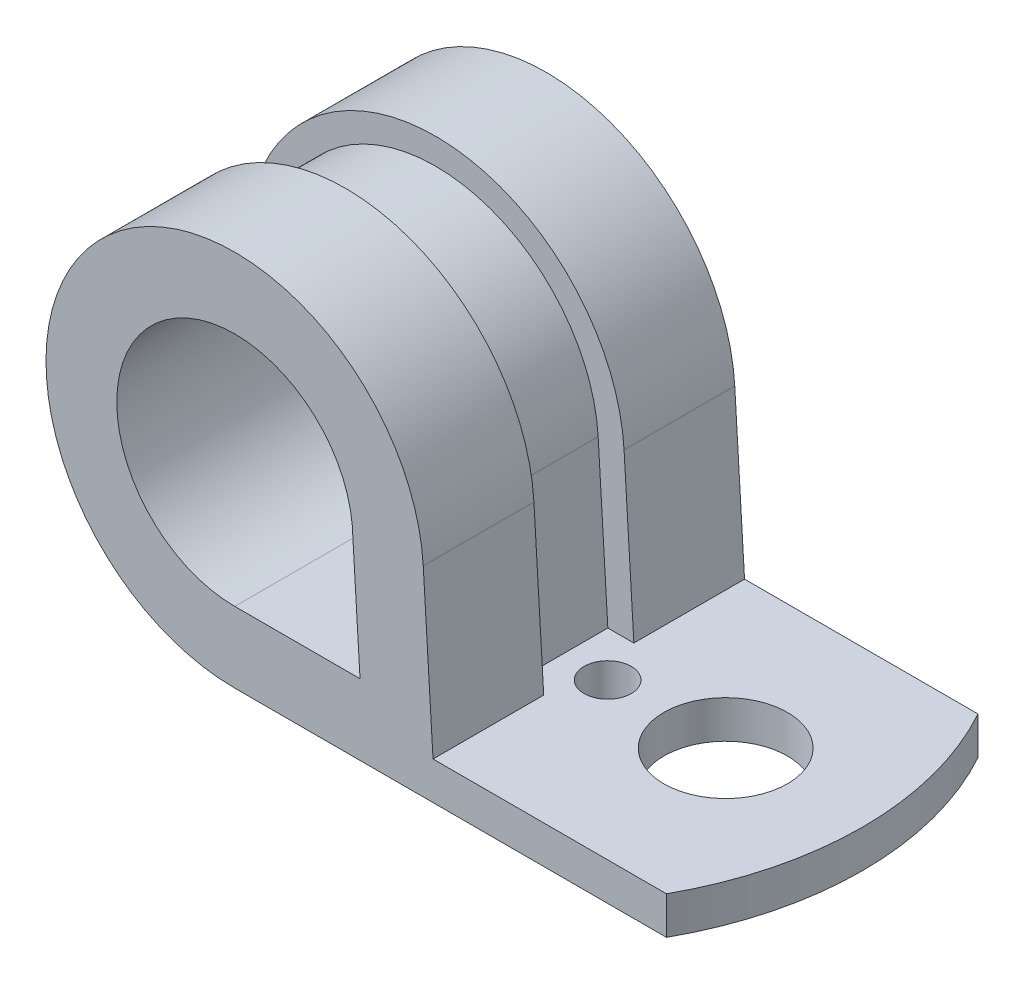
ISO-10303-21;
HEADER;
FILE_DESCRIPTION(('STEP AP214'),'2;1');
FILE_NAME('part.step','',(''),(''),'','','');
FILE_SCHEMA(('AUTOMOTIVE_DESIGN { 1 0 10303 214 1 1 1 1 }'));
ENDSEC;
DATA;
#1=APPLICATION_CONTEXT('core data for automotive mechanical design processes');
#2=APPLICATION_PROTOCOL_DEFINITION('international standard','automotive_design',2000,#1);
#3=PRODUCT_CONTEXT('',#1,'mechanical');
#4=PRODUCT('Part','Part','',(#3));
#5=PRODUCT_RELATED_PRODUCT_CATEGORY('part','',(#4));
#6=PRODUCT_DEFINITION_FORMATION('','',#4);
#7=PRODUCT_DEFINITION_CONTEXT('part definition',#1,'design');
#8=PRODUCT_DEFINITION('design','',#6,#7);
#9=PRODUCT_DEFINITION_SHAPE('','',#8);
#10=(LENGTH_UNIT() NAMED_UNIT(*) SI_UNIT(.MILLI.,.METRE.));
#11=(NAMED_UNIT(*) PLANE_ANGLE_UNIT() SI_UNIT($,.RADIAN.));
#12=(NAMED_UNIT(*) SI_UNIT($,.STERADIAN.) SOLID_ANGLE_UNIT());
#13=UNCERTAINTY_MEASURE_WITH_UNIT(LENGTH_MEASURE(1.E-05),#10,'distance_accuracy_value','');
#14=(GEOMETRIC_REPRESENTATION_CONTEXT(3) GLOBAL_UNCERTAINTY_ASSIGNED_CONTEXT((#13)) GLOBAL_UNIT_ASSIGNED_CONTEXT((#10,
#11,#12)) REPRESENTATION_CONTEXT('',''));
#15=CARTESIAN_POINT('',(0.,0.,0.));
#16=DIRECTION('',(0.,0.,1.));
#17=DIRECTION('',(1.,0.,0.));
#18=AXIS2_PLACEMENT_3D('',#15,#16,#17);
#19=CARTESIAN_POINT('',(0.,0.,8.382));
#20=DIRECTION('',(0.,1.,0.));
#21=DIRECTION('',(-1.,0.,0.));
#22=AXIS2_PLACEMENT_3D('',#19,#20,#21);
#23=PLANE('',#22);
#24=CARTESIAN_POINT('',(-7.366,0.,0.));
#25=DIRECTION('',(0.,1.,0.));
#26=DIRECTION('',(0.,0.,1.));
#27=AXIS2_PLACEMENT_3D('',#24,#25,#26);
#28=CIRCLE('',#27,3.3274);
#29=CARTESIAN_POINT('',(-7.366,0.,3.3274));
#30=VERTEX_POINT('',#29);
#31=EDGE_CURVE('E238',#30,#30,#28,.T.);
#32=ORIENTED_EDGE('',*,*,#31,.T.);
#33=EDGE_LOOP('',(#32));
#34=FACE_BOUND('',#33,.T.);
#35=CARTESIAN_POINT('',(-13.716,0.,0.));
#36=DIRECTION('',(0.,1.,0.));
#37=DIRECTION('',(0.,0.,1.));
#38=AXIS2_PLACEMENT_3D('',#35,#36,#37);
#39=CIRCLE('',#38,1.27);
#40=CARTESIAN_POINT('',(-13.716,0.,1.27));
#41=VERTEX_POINT('',#40);
#42=EDGE_CURVE('E242',#41,#41,#39,.T.);
#43=ORIENTED_EDGE('',*,*,#42,.T.);
#44=EDGE_LOOP('',(#43));
#45=FACE_BOUND('',#44,.T.);
#46=DIRECTION('',(1.,0.,0.));
#47=VECTOR('',#46,1.);
#48=CARTESIAN_POINT('',(-25.4,0.,-2.4257));
#49=LINE('',#48,#47);
#50=CARTESIAN_POINT('',(-25.4,0.,-2.4257));
#51=VERTEX_POINT('',#50);
#52=CARTESIAN_POINT('',(-18.4306740343172,0.,-2.4257));
#53=VERTEX_POINT('',#52);
#54=EDGE_CURVE('E150',#51,#53,#49,.T.);
#55=ORIENTED_EDGE('',*,*,#54,.F.);
#56=DIRECTION('',(0.,0.,-1.));
#57=VECTOR('',#56,1.);
#58=CARTESIAN_POINT('',(-25.4,0.,8.382));
#59=LINE('',#58,#57);
#60=CARTESIAN_POINT('',(-25.4,0.,-8.382));
#61=VERTEX_POINT('',#60);
#62=EDGE_CURVE('E161',#51,#61,#59,.T.);
#63=ORIENTED_EDGE('',*,*,#62,.T.);
#64=DIRECTION('',(1.,0.,0.));
#65=VECTOR('',#64,1.);
#66=CARTESIAN_POINT('',(0.,0.,-8.382));
#67=LINE('',#66,#65);
#68=CARTESIAN_POINT('',(-2.16809368914395,0.,-8.382));
#69=VERTEX_POINT('',#68);
#70=EDGE_CURVE('E180',#61,#69,#67,.T.);
#71=ORIENTED_EDGE('',*,*,#70,.T.);
#72=CARTESIAN_POINT('',(-17.2867424088353,0.,0.));
#73=DIRECTION('',(0.,1.,0.));
#74=DIRECTION('',(0.,0.,1.));
#75=AXIS2_PLACEMENT_3D('',#72,#73,#74);
#76=CIRCLE('',#75,17.2867424088353);
#77=CARTESIAN_POINT('',(-2.16809368914395,0.,8.382));
#78=VERTEX_POINT('',#77);
#79=EDGE_CURVE('E231',#78,#69,#76,.T.);
#80=ORIENTED_EDGE('',*,*,#79,.F.);
#81=DIRECTION('',(1.,0.,0.));
#82=VECTOR('',#81,1.);
#83=CARTESIAN_POINT('',(0.,0.,8.382));
#84=LINE('',#83,#82);
#85=CARTESIAN_POINT('',(-25.4,0.,8.382));
#86=VERTEX_POINT('',#85);
#87=EDGE_CURVE('E172',#86,#78,#84,.T.);
#88=ORIENTED_EDGE('',*,*,#87,.F.);
#89=CARTESIAN_POINT('',(-25.4,0.,2.4257));
#90=VERTEX_POINT('',#89);
#91=EDGE_CURVE('E171',#86,#90,#59,.T.);
#92=ORIENTED_EDGE('',*,*,#91,.T.);
#93=DIRECTION('',(1.,0.,0.));
#94=VECTOR('',#93,1.);
#95=CARTESIAN_POINT('',(-25.4,0.,2.4257));
#96=LINE('',#95,#94);
#97=CARTESIAN_POINT('',(-18.4306740343172,0.,2.4257));
#98=VERTEX_POINT('',#97);
#99=EDGE_CURVE('E275',#90,#98,#96,.T.);
#100=ORIENTED_EDGE('',*,*,#99,.T.);
#101=DIRECTION('',(0.,0.,1.));
#102=VECTOR('',#101,1.);
#103=CARTESIAN_POINT('',(-18.4306740343172,0.,-2.4257));
#104=LINE('',#103,#102);
#105=EDGE_CURVE('E164',#53,#98,#104,.T.);
#106=ORIENTED_EDGE('',*,*,#105,.F.);
#107=EDGE_LOOP('',(#55,#63,#71,#80,#88,#92,#100,#106));
#108=FACE_BOUND('',#107,.T.);
#109=ADVANCED_FACE('F33',(#34,#45,#108),#23,.F.);
#110=CARTESIAN_POINT('',(-15.2583811887178,10.7708746898078,8.382));
#111=DIRECTION('',(-0.998190827882103,-0.0601254615952593,0.));
#112=DIRECTION('',(0.0601254615952593,-0.998190827882103,0.));
#113=AXIS2_PLACEMENT_3D('',#110,#111,#112);
#114=PLANE('',#113);
#115=DIRECTION('',(-0.0601254615952593,0.998190827882103,0.));
#116=VECTOR('',#115,1.);
#117=CARTESIAN_POINT('',(-14.732,2.032,-2.4257));
#118=LINE('',#117,#116);
#119=CARTESIAN_POINT('',(-14.732,2.032,-2.4257));
#120=VERTEX_POINT('',#119);
#121=CARTESIAN_POINT('',(-15.2583811887178,10.7708746898078,-2.4257));
#122=VERTEX_POINT('',#121);
#123=EDGE_CURVE('E153',#120,#122,#118,.T.);
#124=ORIENTED_EDGE('',*,*,#123,.F.);
#125=DIRECTION('',(0.,0.,-1.));
#126=VECTOR('',#125,1.);
#127=CARTESIAN_POINT('',(-14.732,2.032,8.382));
#128=LINE('',#127,#126);
#129=CARTESIAN_POINT('',(-14.732,2.032,-8.382));
#130=VERTEX_POINT('',#129);
#131=EDGE_CURVE('E41',#120,#130,#128,.T.);
#132=ORIENTED_EDGE('',*,*,#131,.T.);
#133=DIRECTION('',(-0.0601254615952593,0.998190827882103,0.));
#134=VECTOR('',#133,1.);
#135=CARTESIAN_POINT('',(-15.2583811887178,10.7708746898078,-8.382));
#136=LINE('',#135,#134);
#137=CARTESIAN_POINT('',(-15.2583811887178,10.7708746898078,-8.382));
#138=VERTEX_POINT('',#137);
#139=EDGE_CURVE('E191',#130,#138,#136,.T.);
#140=ORIENTED_EDGE('',*,*,#139,.T.);
#141=DIRECTION('',(0.,0.,-1.));
#142=VECTOR('',#141,1.);
#143=CARTESIAN_POINT('',(-15.2583811887178,10.7708746898078,8.382));
#144=LINE('',#143,#142);
#145=EDGE_CURVE('E175',#122,#138,#144,.T.);
#146=ORIENTED_EDGE('',*,*,#145,.F.);
#147=EDGE_LOOP('',(#124,#132,#140,#146));
#148=FACE_BOUND('',#147,.T.);
#149=ADVANCED_FACE('F192',(#148),#114,.F.);
#150=CARTESIAN_POINT('',(-25.4,10.1599999999999,8.382));
#151=DIRECTION('',(0.,0.,-1.));
#152=DIRECTION('',(-1.,0.,0.));
#153=AXIS2_PLACEMENT_3D('',#150,#151,#152);
#154=CYLINDRICAL_SURFACE('',#153,10.16);
#155=CARTESIAN_POINT('',(-25.4,10.1599999999999,-2.4257));
#156=DIRECTION('',(0.,0.,1.));
#157=DIRECTION('',(1.,0.,0.));
#158=AXIS2_PLACEMENT_3D('',#155,#156,#157);
#159=CIRCLE('',#158,10.16);
#160=EDGE_CURVE('E146',#122,#51,#159,.T.);
#161=ORIENTED_EDGE('',*,*,#160,.F.);
#162=ORIENTED_EDGE('',*,*,#145,.T.);
#163=CARTESIAN_POINT('',(-25.4,10.1599999999999,-8.382));
#164=DIRECTION('',(0.,0.,1.));
#165=DIRECTION('',(1.,0.,0.));
#166=AXIS2_PLACEMENT_3D('',#163,#164,#165);
#167=CIRCLE('',#166,10.16);
#168=EDGE_CURVE('E169',#138,#61,#167,.T.);
#169=ORIENTED_EDGE('',*,*,#168,.T.);
#170=ORIENTED_EDGE('',*,*,#62,.F.);
#171=EDGE_LOOP('',(#161,#162,#169,#170));
#172=FACE_BOUND('',#171,.T.);
#173=ADVANCED_FACE('F167',(#172),#154,.T.);
#174=CARTESIAN_POINT('',(-14.732,2.032,8.382));
#175=DIRECTION('',(0.,-1.,0.));
#176=DIRECTION('',(0.,0.,-1.));
#177=AXIS2_PLACEMENT_3D('',#174,#175,#176);
#178=PLANE('',#177);
#179=ORIENTED_EDGE('',*,*,#131,.F.);
#180=DIRECTION('',(1.,0.,0.));
#181=VECTOR('',#180,1.);
#182=CARTESIAN_POINT('',(-14.732,2.032,-2.4257));
#183=LINE('',#182,#181);
#184=CARTESIAN_POINT('',(-16.1315319942621,2.032,-2.4257));
#185=VERTEX_POINT('',#184);
#186=EDGE_CURVE('E280',#185,#120,#183,.T.);
#187=ORIENTED_EDGE('',*,*,#186,.F.);
#188=DIRECTION('',(0.,0.,1.));
#189=VECTOR('',#188,1.);
#190=CARTESIAN_POINT('',(-16.1315319942621,2.032,-2.4257));
#191=LINE('',#190,#189);
#192=CARTESIAN_POINT('',(-16.1315319942621,2.032,2.4257));
#193=VERTEX_POINT('',#192);
#194=EDGE_CURVE('E248',#185,#193,#191,.T.);
#195=ORIENTED_EDGE('',*,*,#194,.T.);
#196=DIRECTION('',(1.,0.,0.));
#197=VECTOR('',#196,1.);
#198=CARTESIAN_POINT('',(-14.732,2.032,2.4257));
#199=LINE('',#198,#197);
#200=CARTESIAN_POINT('',(-14.732,2.032,2.4257));
#201=VERTEX_POINT('',#200);
#202=EDGE_CURVE('E261',#193,#201,#199,.T.);
#203=ORIENTED_EDGE('',*,*,#202,.T.);
#204=CARTESIAN_POINT('',(-14.732,2.032,8.382));
#205=VERTEX_POINT('',#204);
#206=EDGE_CURVE('E11',#205,#201,#128,.T.);
#207=ORIENTED_EDGE('',*,*,#206,.F.);
#208=DIRECTION('',(-1.,0.,0.));
#209=VECTOR('',#208,1.);
#210=CARTESIAN_POINT('',(-14.732,2.032,8.382));
#211=LINE('',#210,#209);
#212=CARTESIAN_POINT('',(-2.16809368914395,2.032,8.382));
#213=VERTEX_POINT('',#212);
#214=EDGE_CURVE('E201',#213,#205,#211,.T.);
#215=ORIENTED_EDGE('',*,*,#214,.F.);
#216=CARTESIAN_POINT('',(-17.2867424088353,2.032,0.));
#217=DIRECTION('',(0.,1.,0.));
#218=DIRECTION('',(0.,0.,1.));
#219=AXIS2_PLACEMENT_3D('',#216,#217,#218);
#220=CIRCLE('',#219,17.2867424088353);
#221=CARTESIAN_POINT('',(-2.16809368914395,2.032,-8.382));
#222=VERTEX_POINT('',#221);
#223=EDGE_CURVE('E232',#213,#222,#220,.T.);
#224=ORIENTED_EDGE('',*,*,#223,.T.);
#225=DIRECTION('',(-1.,0.,0.));
#226=VECTOR('',#225,1.);
#227=CARTESIAN_POINT('',(-14.732,2.032,-8.382));
#228=LINE('',#227,#226);
#229=EDGE_CURVE('E197',#222,#130,#228,.T.);
#230=ORIENTED_EDGE('',*,*,#229,.T.);
#231=EDGE_LOOP('',(#179,#187,#195,#203,#207,#215,#224,#230));
#232=FACE_BOUND('',#231,.T.);
#233=CARTESIAN_POINT('',(-7.366,2.032,0.));
#234=DIRECTION('',(0.,1.,0.));
#235=DIRECTION('',(0.,0.,1.));
#236=AXIS2_PLACEMENT_3D('',#233,#234,#235);
#237=CIRCLE('',#236,3.3274);
#238=CARTESIAN_POINT('',(-7.366,2.032,3.3274));
#239=VERTEX_POINT('',#238);
#240=EDGE_CURVE('E239',#239,#239,#237,.T.);
#241=ORIENTED_EDGE('',*,*,#240,.F.);
#242=EDGE_LOOP('',(#241));
#243=FACE_BOUND('',#242,.T.);
#244=CARTESIAN_POINT('',(-13.716,2.032,0.));
#245=DIRECTION('',(0.,1.,0.));
#246=DIRECTION('',(0.,0.,1.));
#247=AXIS2_PLACEMENT_3D('',#244,#245,#246);
#248=CIRCLE('',#247,1.27);
#249=CARTESIAN_POINT('',(-13.716,2.032,1.27));
#250=VERTEX_POINT('',#249);
#251=EDGE_CURVE('E245',#250,#250,#248,.T.);
#252=ORIENTED_EDGE('',*,*,#251,.F.);
#253=EDGE_LOOP('',(#252));
#254=FACE_BOUND('',#253,.T.);
#255=ADVANCED_FACE('F35',(#232,#243,#254),#178,.F.);
#256=CARTESIAN_POINT('',(-25.4,10.1599999999999,-8.382));
#257=DIRECTION('',(0.,0.,1.));
#258=DIRECTION('',(1.,0.,0.));
#259=AXIS2_PLACEMENT_3D('',#256,#257,#258);
#260=PLANE('',#259);
#261=CARTESIAN_POINT('',(-25.4,10.1599999999999,-8.382));
#262=DIRECTION('',(0.,0.,1.));
#263=DIRECTION('',(1.,0.,0.));
#264=AXIS2_PLACEMENT_3D('',#261,#262,#263);
#265=CIRCLE('',#264,6.35);
#266=CARTESIAN_POINT('',(-19.0794515971039,10.7708746898078,-8.382));
#267=VERTEX_POINT('',#266);
#268=CARTESIAN_POINT('',(-25.4,3.80999999999992,-8.382));
#269=VERTEX_POINT('',#268);
#270=EDGE_CURVE('E223',#267,#269,#265,.T.);
#271=ORIENTED_EDGE('',*,*,#270,.T.);
#272=DIRECTION('',(1.,0.,0.));
#273=VECTOR('',#272,1.);
#274=CARTESIAN_POINT('',(-25.4,3.80999999999992,-8.382));
#275=LINE('',#274,#273);
#276=CARTESIAN_POINT('',(-18.6601672356963,3.80999999999992,-8.382));
#277=VERTEX_POINT('',#276);
#278=EDGE_CURVE('E220',#269,#277,#275,.T.);
#279=ORIENTED_EDGE('',*,*,#278,.T.);
#280=DIRECTION('',(-0.0601254615952589,0.998190827882102,0.));
#281=VECTOR('',#280,1.);
#282=CARTESIAN_POINT('',(-19.0794515971039,10.7708746898078,-8.382));
#283=LINE('',#282,#281);
#284=EDGE_CURVE('E216',#277,#267,#283,.T.);
#285=ORIENTED_EDGE('',*,*,#284,.T.);
#286=EDGE_LOOP('',(#271,#279,#285));
#287=FACE_BOUND('',#286,.T.);
#288=DIRECTION('',(0.,1.,0.));
#289=VECTOR('',#288,1.);
#290=CARTESIAN_POINT('',(-2.16809368914395,0.,-8.382));
#291=LINE('',#290,#289);
#292=EDGE_CURVE('E234',#69,#222,#291,.T.);
#293=ORIENTED_EDGE('',*,*,#292,.F.);
#294=ORIENTED_EDGE('',*,*,#70,.F.);
#295=ORIENTED_EDGE('',*,*,#168,.F.);
#296=ORIENTED_EDGE('',*,*,#139,.F.);
#297=ORIENTED_EDGE('',*,*,#229,.F.);
#298=EDGE_LOOP('',(#293,#294,#295,#296,#297));
#299=FACE_BOUND('',#298,.T.);
#300=ADVANCED_FACE('F200',(#287,#299),#260,.F.);
#301=CARTESIAN_POINT('',(-25.4,10.1599999999999,8.382));
#302=DIRECTION('',(0.,0.,1.));
#303=DIRECTION('',(1.,0.,0.));
#304=AXIS2_PLACEMENT_3D('',#301,#302,#303);
#305=PLANE('',#304);
#306=DIRECTION('',(1.,0.,0.));
#307=VECTOR('',#306,1.);
#308=CARTESIAN_POINT('',(-25.4,3.80999999999992,8.382));
#309=LINE('',#308,#307);
#310=CARTESIAN_POINT('',(-25.4,3.80999999999992,8.382));
#311=VERTEX_POINT('',#310);
#312=CARTESIAN_POINT('',(-18.6601672356963,3.80999999999992,8.382));
#313=VERTEX_POINT('',#312);
#314=EDGE_CURVE('E227',#311,#313,#309,.T.);
#315=ORIENTED_EDGE('',*,*,#314,.F.);
#316=CARTESIAN_POINT('',(-25.4,10.1599999999999,8.382));
#317=DIRECTION('',(0.,0.,1.));
#318=DIRECTION('',(1.,0.,0.));
#319=AXIS2_PLACEMENT_3D('',#316,#317,#318);
#320=CIRCLE('',#319,6.35);
#321=CARTESIAN_POINT('',(-19.0794515971039,10.7708746898078,8.382));
#322=VERTEX_POINT('',#321);
#323=EDGE_CURVE('E219',#322,#311,#320,.T.);
#324=ORIENTED_EDGE('',*,*,#323,.F.);
#325=DIRECTION('',(-0.0601254615952589,0.998190827882102,0.));
#326=VECTOR('',#325,1.);
#327=CARTESIAN_POINT('',(-19.0794515971039,10.7708746898078,8.382));
#328=LINE('',#327,#326);
#329=EDGE_CURVE('E215',#313,#322,#328,.T.);
#330=ORIENTED_EDGE('',*,*,#329,.F.);
#331=EDGE_LOOP('',(#315,#324,#330));
#332=FACE_BOUND('',#331,.T.);
#333=ORIENTED_EDGE('',*,*,#87,.T.);
#334=DIRECTION('',(0.,1.,0.));
#335=VECTOR('',#334,1.);
#336=CARTESIAN_POINT('',(-2.16809368914395,0.,8.382));
#337=LINE('',#336,#335);
#338=EDGE_CURVE('E48',#78,#213,#337,.T.);
#339=ORIENTED_EDGE('',*,*,#338,.T.);
#340=ORIENTED_EDGE('',*,*,#214,.T.);
#341=DIRECTION('',(-0.0601254615952593,0.998190827882103,0.));
#342=VECTOR('',#341,1.);
#343=CARTESIAN_POINT('',(-15.2583811887178,10.7708746898078,8.382));
#344=LINE('',#343,#342);
#345=CARTESIAN_POINT('',(-15.2583811887178,10.7708746898078,8.382));
#346=VERTEX_POINT('',#345);
#347=EDGE_CURVE('E206',#205,#346,#344,.T.);
#348=ORIENTED_EDGE('',*,*,#347,.T.);
#349=CARTESIAN_POINT('',(-25.4,10.1599999999999,8.382));
#350=DIRECTION('',(0.,0.,1.));
#351=DIRECTION('',(1.,0.,0.));
#352=AXIS2_PLACEMENT_3D('',#349,#350,#351);
#353=CIRCLE('',#352,10.16);
#354=EDGE_CURVE('E177',#346,#86,#353,.T.);
#355=ORIENTED_EDGE('',*,*,#354,.T.);
#356=EDGE_LOOP('',(#333,#339,#340,#348,#355));
#357=FACE_BOUND('',#356,.T.);
#358=ADVANCED_FACE('F313',(#332,#357),#305,.T.);
#359=ORIENTED_EDGE('',*,*,#206,.T.);
#360=DIRECTION('',(-0.0601254615952593,0.998190827882103,0.));
#361=VECTOR('',#360,1.);
#362=CARTESIAN_POINT('',(-14.732,2.032,2.4257));
#363=LINE('',#362,#361);
#364=CARTESIAN_POINT('',(-15.2583811887178,10.7708746898078,2.4257));
#365=VERTEX_POINT('',#364);
#366=EDGE_CURVE('E157',#201,#365,#363,.T.);
#367=ORIENTED_EDGE('',*,*,#366,.T.);
#368=EDGE_CURVE('E182',#346,#365,#144,.T.);
#369=ORIENTED_EDGE('',*,*,#368,.F.);
#370=ORIENTED_EDGE('',*,*,#347,.F.);
#371=EDGE_LOOP('',(#359,#367,#369,#370));
#372=FACE_BOUND('',#371,.T.);
#373=ADVANCED_FACE('F322',(#372),#114,.F.);
#374=ORIENTED_EDGE('',*,*,#368,.T.);
#375=CARTESIAN_POINT('',(-25.4,10.1599999999999,2.4257));
#376=DIRECTION('',(0.,0.,1.));
#377=DIRECTION('',(1.,0.,0.));
#378=AXIS2_PLACEMENT_3D('',#375,#376,#377);
#379=CIRCLE('',#378,10.16);
#380=EDGE_CURVE('E277',#365,#90,#379,.T.);
#381=ORIENTED_EDGE('',*,*,#380,.T.);
#382=ORIENTED_EDGE('',*,*,#91,.F.);
#383=ORIENTED_EDGE('',*,*,#354,.F.);
#384=EDGE_LOOP('',(#374,#381,#382,#383));
#385=FACE_BOUND('',#384,.T.);
#386=ADVANCED_FACE('F316',(#385),#154,.T.);
#387=CARTESIAN_POINT('',(-25.4,10.1599999999999,8.382));
#388=DIRECTION('',(0.,0.,-1.));
#389=DIRECTION('',(-1.,0.,0.));
#390=AXIS2_PLACEMENT_3D('',#387,#388,#389);
#391=CYLINDRICAL_SURFACE('',#390,6.35);
#392=ORIENTED_EDGE('',*,*,#270,.F.);
#393=DIRECTION('',(0.,0.,-1.));
#394=VECTOR('',#393,1.);
#395=CARTESIAN_POINT('',(-19.0794515971039,10.7708746898078,8.382));
#396=LINE('',#395,#394);
#397=EDGE_CURVE('E212',#322,#267,#396,.T.);
#398=ORIENTED_EDGE('',*,*,#397,.F.);
#399=ORIENTED_EDGE('',*,*,#323,.T.);
#400=DIRECTION('',(0.,0.,-1.));
#401=VECTOR('',#400,1.);
#402=CARTESIAN_POINT('',(-25.4,3.80999999999992,8.382));
#403=LINE('',#402,#401);
#404=EDGE_CURVE('E203',#311,#269,#403,.T.);
#405=ORIENTED_EDGE('',*,*,#404,.T.);
#406=EDGE_LOOP('',(#392,#398,#399,#405));
#407=FACE_BOUND('',#406,.T.);
#408=ADVANCED_FACE('F328',(#407),#391,.F.);
#409=CARTESIAN_POINT('',(-25.4,3.80999999999992,8.382));
#410=DIRECTION('',(0.,1.,0.));
#411=DIRECTION('',(-1.,0.,0.));
#412=AXIS2_PLACEMENT_3D('',#409,#410,#411);
#413=PLANE('',#412);
#414=ORIENTED_EDGE('',*,*,#278,.F.);
#415=ORIENTED_EDGE('',*,*,#404,.F.);
#416=ORIENTED_EDGE('',*,*,#314,.T.);
#417=DIRECTION('',(0.,0.,-1.));
#418=VECTOR('',#417,1.);
#419=CARTESIAN_POINT('',(-18.6601672356963,3.80999999999992,8.382));
#420=LINE('',#419,#418);
#421=EDGE_CURVE('E56',#313,#277,#420,.T.);
#422=ORIENTED_EDGE('',*,*,#421,.T.);
#423=EDGE_LOOP('',(#414,#415,#416,#422));
#424=FACE_BOUND('',#423,.T.);
#425=ADVANCED_FACE('F345',(#424),#413,.T.);
#426=CARTESIAN_POINT('',(-19.0794515971039,10.7708746898078,8.382));
#427=DIRECTION('',(-0.998190827882103,-0.0601254615952589,0.));
#428=DIRECTION('',(0.0601254615952589,-0.998190827882103,0.));
#429=AXIS2_PLACEMENT_3D('',#426,#427,#428);
#430=PLANE('',#429);
#431=ORIENTED_EDGE('',*,*,#284,.F.);
#432=ORIENTED_EDGE('',*,*,#421,.F.);
#433=ORIENTED_EDGE('',*,*,#329,.T.);
#434=ORIENTED_EDGE('',*,*,#397,.T.);
#435=EDGE_LOOP('',(#431,#432,#433,#434));
#436=FACE_BOUND('',#435,.T.);
#437=ADVANCED_FACE('F349',(#436),#430,.T.);
#438=CARTESIAN_POINT('',(-17.2867424088353,0.,0.));
#439=DIRECTION('',(0.,1.,0.));
#440=DIRECTION('',(0.,0.,1.));
#441=AXIS2_PLACEMENT_3D('',#438,#439,#440);
#442=CYLINDRICAL_SURFACE('',#441,17.2867424088353);
#443=ORIENTED_EDGE('',*,*,#223,.F.);
#444=ORIENTED_EDGE('',*,*,#338,.F.);
#445=ORIENTED_EDGE('',*,*,#79,.T.);
#446=ORIENTED_EDGE('',*,*,#292,.T.);
#447=EDGE_LOOP('',(#443,#444,#445,#446));
#448=FACE_BOUND('',#447,.T.);
#449=ADVANCED_FACE('F353',(#448),#442,.T.);
#450=CARTESIAN_POINT('',(-7.366,0.,0.));
#451=DIRECTION('',(0.,1.,0.));
#452=DIRECTION('',(0.,0.,1.));
#453=AXIS2_PLACEMENT_3D('',#450,#451,#452);
#454=CYLINDRICAL_SURFACE('',#453,3.3274);
#455=ORIENTED_EDGE('',*,*,#31,.F.);
#456=EDGE_LOOP('',(#455));
#457=FACE_BOUND('',#456,.T.);
#458=ORIENTED_EDGE('',*,*,#240,.T.);
#459=EDGE_LOOP('',(#458));
#460=FACE_BOUND('',#459,.T.);
#461=ADVANCED_FACE('F356',(#457,#460),#454,.F.);
#462=CARTESIAN_POINT('',(-13.716,0.,0.));
#463=DIRECTION('',(0.,1.,0.));
#464=DIRECTION('',(0.,0.,1.));
#465=AXIS2_PLACEMENT_3D('',#462,#463,#464);
#466=CYLINDRICAL_SURFACE('',#465,1.27);
#467=ORIENTED_EDGE('',*,*,#42,.F.);
#468=EDGE_LOOP('',(#467));
#469=FACE_BOUND('',#468,.T.);
#470=ORIENTED_EDGE('',*,*,#251,.T.);
#471=EDGE_LOOP('',(#470));
#472=FACE_BOUND('',#471,.T.);
#473=ADVANCED_FACE('F359',(#469,#472),#466,.F.);
#474=CARTESIAN_POINT('',(-16.1315319942621,2.032,-2.4257));
#475=DIRECTION('',(-0.998190827882102,-0.0601254615952593,0.));
#476=DIRECTION('',(0.0601254615952593,-0.998190827882103,0.));
#477=AXIS2_PLACEMENT_3D('',#474,#475,#476);
#478=PLANE('',#477);
#479=DIRECTION('',(0.0601254615952593,-0.998190827882102,0.));
#480=VECTOR('',#479,1.);
#481=CARTESIAN_POINT('',(-16.1315319942621,2.032,2.4257));
#482=LINE('',#481,#480);
#483=CARTESIAN_POINT('',(-16.6528537752691,10.6868794199592,2.4257));
#484=VERTEX_POINT('',#483);
#485=EDGE_CURVE('E263',#484,#193,#482,.T.);
#486=ORIENTED_EDGE('',*,*,#485,.T.);
#487=ORIENTED_EDGE('',*,*,#194,.F.);
#488=DIRECTION('',(0.0601254615952593,-0.998190827882102,0.));
#489=VECTOR('',#488,1.);
#490=CARTESIAN_POINT('',(-16.1315319942621,2.032,-2.4257));
#491=LINE('',#490,#489);
#492=CARTESIAN_POINT('',(-16.6528537752691,10.6868794199592,-2.4257));
#493=VERTEX_POINT('',#492);
#494=EDGE_CURVE('E282',#493,#185,#491,.T.);
#495=ORIENTED_EDGE('',*,*,#494,.F.);
#496=DIRECTION('',(0.,0.,1.));
#497=VECTOR('',#496,1.);
#498=CARTESIAN_POINT('',(-16.6528537752691,10.6868794199592,-2.4257));
#499=LINE('',#498,#497);
#500=EDGE_CURVE('E256',#493,#484,#499,.T.);
#501=ORIENTED_EDGE('',*,*,#500,.T.);
#502=EDGE_LOOP('',(#486,#487,#495,#501));
#503=FACE_BOUND('',#502,.T.);
#504=ADVANCED_FACE('F305',(#503),#478,.F.);
#505=CARTESIAN_POINT('',(-25.4,10.1599999999999,-2.4257));
#506=DIRECTION('',(0.,0.,1.));
#507=DIRECTION('',(1.,0.,0.));
#508=AXIS2_PLACEMENT_3D('',#505,#506,#507);
#509=CYLINDRICAL_SURFACE('',#508,8.763);
#510=CARTESIAN_POINT('',(-25.4,10.1599999999999,2.4257));
#511=DIRECTION('',(0.,0.,-1.));
#512=DIRECTION('',(1.,0.,0.));
#513=AXIS2_PLACEMENT_3D('',#510,#511,#512);
#514=CIRCLE('',#513,8.763);
#515=CARTESIAN_POINT('',(-25.4,1.39699999999993,2.4257));
#516=VERTEX_POINT('',#515);
#517=EDGE_CURVE('E266',#516,#484,#514,.T.);
#518=ORIENTED_EDGE('',*,*,#517,.T.);
#519=ORIENTED_EDGE('',*,*,#500,.F.);
#520=CARTESIAN_POINT('',(-25.4,10.1599999999999,-2.4257));
#521=DIRECTION('',(0.,0.,-1.));
#522=DIRECTION('',(1.,0.,0.));
#523=AXIS2_PLACEMENT_3D('',#520,#521,#522);
#524=CIRCLE('',#523,8.763);
#525=CARTESIAN_POINT('',(-25.4,1.39699999999993,-2.4257));
#526=VERTEX_POINT('',#525);
#527=EDGE_CURVE('E285',#526,#493,#524,.T.);
#528=ORIENTED_EDGE('',*,*,#527,.F.);
#529=DIRECTION('',(0.,0.,1.));
#530=VECTOR('',#529,1.);
#531=CARTESIAN_POINT('',(-25.4,1.39699999999993,-2.4257));
#532=LINE('',#531,#530);
#533=EDGE_CURVE('E254',#526,#516,#532,.T.);
#534=ORIENTED_EDGE('',*,*,#533,.T.);
#535=EDGE_LOOP('',(#518,#519,#528,#534));
#536=FACE_BOUND('',#535,.T.);
#537=ADVANCED_FACE('F301',(#536),#509,.T.);
#538=CARTESIAN_POINT('',(-25.4,1.39699999999993,-2.4257));
#539=DIRECTION('',(0.,1.,0.));
#540=DIRECTION('',(0.,0.,1.));
#541=AXIS2_PLACEMENT_3D('',#538,#539,#540);
#542=PLANE('',#541);
#543=DIRECTION('',(-1.,0.,0.));
#544=VECTOR('',#543,1.);
#545=CARTESIAN_POINT('',(-25.4,1.39699999999993,2.4257));
#546=LINE('',#545,#544);
#547=CARTESIAN_POINT('',(-18.5148215414896,1.39699999999993,2.4257));
#548=VERTEX_POINT('',#547);
#549=EDGE_CURVE('E269',#548,#516,#546,.T.);
#550=ORIENTED_EDGE('',*,*,#549,.T.);
#551=ORIENTED_EDGE('',*,*,#533,.F.);
#552=DIRECTION('',(-1.,0.,0.));
#553=VECTOR('',#552,1.);
#554=CARTESIAN_POINT('',(-25.4,1.39699999999993,-2.4257));
#555=LINE('',#554,#553);
#556=CARTESIAN_POINT('',(-18.5148215414896,1.39699999999993,-2.4257));
#557=VERTEX_POINT('',#556);
#558=EDGE_CURVE('E288',#557,#526,#555,.T.);
#559=ORIENTED_EDGE('',*,*,#558,.F.);
#560=DIRECTION('',(0.,0.,1.));
#561=VECTOR('',#560,1.);
#562=CARTESIAN_POINT('',(-18.5148215414896,1.39699999999993,-2.4257));
#563=LINE('',#562,#561);
#564=EDGE_CURVE('E252',#557,#548,#563,.T.);
#565=ORIENTED_EDGE('',*,*,#564,.T.);
#566=EDGE_LOOP('',(#550,#551,#559,#565));
#567=FACE_BOUND('',#566,.T.);
#568=ADVANCED_FACE('F297',(#567),#542,.F.);
#569=CARTESIAN_POINT('',(-18.5148215414896,1.39699999999993,-2.4257));
#570=DIRECTION('',(0.998190827882102,0.060125461595261,0.));
#571=DIRECTION('',(-0.060125461595261,0.998190827882102,0.));
#572=AXIS2_PLACEMENT_3D('',#569,#570,#571);
#573=PLANE('',#572);
#574=DIRECTION('',(-0.060125461595261,0.998190827882102,0.));
#575=VECTOR('',#574,1.);
#576=CARTESIAN_POINT('',(-18.5148215414896,1.39699999999993,2.4257));
#577=LINE('',#576,#575);
#578=EDGE_CURVE('E272',#98,#548,#577,.T.);
#579=ORIENTED_EDGE('',*,*,#578,.T.);
#580=ORIENTED_EDGE('',*,*,#564,.F.);
#581=DIRECTION('',(-0.060125461595261,0.998190827882102,0.));
#582=VECTOR('',#581,1.);
#583=CARTESIAN_POINT('',(-18.5148215414896,1.39699999999993,-2.4257));
#584=LINE('',#583,#582);
#585=EDGE_CURVE('E165',#53,#557,#584,.T.);
#586=ORIENTED_EDGE('',*,*,#585,.F.);
#587=ORIENTED_EDGE('',*,*,#105,.T.);
#588=EDGE_LOOP('',(#579,#580,#586,#587));
#589=FACE_BOUND('',#588,.T.);
#590=ADVANCED_FACE('F293',(#589),#573,.F.);
#591=CARTESIAN_POINT('',(-25.4,10.1599999999999,-2.4257));
#592=DIRECTION('',(0.,0.,1.));
#593=DIRECTION('',(1.,0.,0.));
#594=AXIS2_PLACEMENT_3D('',#591,#592,#593);
#595=PLANE('',#594);
#596=ORIENTED_EDGE('',*,*,#160,.T.);
#597=ORIENTED_EDGE('',*,*,#54,.T.);
#598=ORIENTED_EDGE('',*,*,#585,.T.);
#599=ORIENTED_EDGE('',*,*,#558,.T.);
#600=ORIENTED_EDGE('',*,*,#527,.T.);
#601=ORIENTED_EDGE('',*,*,#494,.T.);
#602=ORIENTED_EDGE('',*,*,#186,.T.);
#603=ORIENTED_EDGE('',*,*,#123,.T.);
#604=EDGE_LOOP('',(#596,#597,#598,#599,#600,#601,#602,#603));
#605=FACE_BOUND('',#604,.T.);
#606=ADVANCED_FACE('F148',(#605),#595,.T.);
#607=CARTESIAN_POINT('',(-25.4,10.1599999999999,2.4257));
#608=DIRECTION('',(0.,0.,1.));
#609=DIRECTION('',(1.,0.,0.));
#610=AXIS2_PLACEMENT_3D('',#607,#608,#609);
#611=PLANE('',#610);
#612=ORIENTED_EDGE('',*,*,#380,.F.);
#613=ORIENTED_EDGE('',*,*,#366,.F.);
#614=ORIENTED_EDGE('',*,*,#202,.F.);
#615=ORIENTED_EDGE('',*,*,#485,.F.);
#616=ORIENTED_EDGE('',*,*,#517,.F.);
#617=ORIENTED_EDGE('',*,*,#549,.F.);
#618=ORIENTED_EDGE('',*,*,#578,.F.);
#619=ORIENTED_EDGE('',*,*,#99,.F.);
#620=EDGE_LOOP('',(#612,#613,#614,#615,#616,#617,#618,#619));
#621=FACE_BOUND('',#620,.T.);
#622=ADVANCED_FACE('F318',(#621),#611,.F.);
#623=CLOSED_SHELL('',(#109,#149,#173,#255,#300,#358,#373,#386,#408,#425,#437,#449,#461,#473,
#504,#537,#568,#590,#606,#622));
#624=MANIFOLD_SOLID_BREP('B2',#623);
#625=ADVANCED_BREP_SHAPE_REPRESENTATION('',(#18,#624),#14);
#626=SHAPE_DEFINITION_REPRESENTATION(#9,#625);
ENDSEC;
END-ISO-10303-21;
